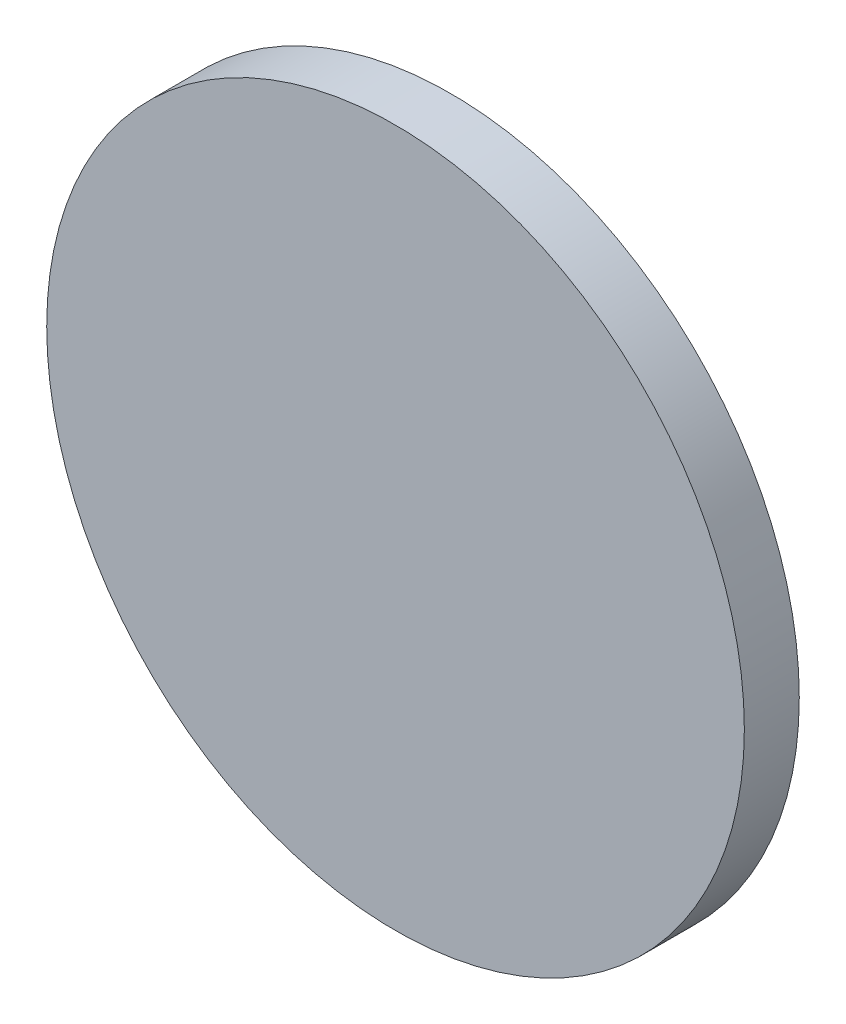
ISO-10303-21;
HEADER;
FILE_DESCRIPTION(('STEP AP214'),'2;1');
FILE_NAME('part.step','',(''),(''),'','','');
FILE_SCHEMA(('AUTOMOTIVE_DESIGN { 1 0 10303 214 1 1 1 1 }'));
ENDSEC;
DATA;
#1=APPLICATION_CONTEXT('core data for automotive mechanical design processes');
#2=APPLICATION_PROTOCOL_DEFINITION('international standard','automotive_design',2000,#1);
#3=PRODUCT_CONTEXT('',#1,'mechanical');
#4=PRODUCT('Part','Part','',(#3));
#5=PRODUCT_RELATED_PRODUCT_CATEGORY('part','',(#4));
#6=PRODUCT_DEFINITION_FORMATION('','',#4);
#7=PRODUCT_DEFINITION_CONTEXT('part definition',#1,'design');
#8=PRODUCT_DEFINITION('design','',#6,#7);
#9=PRODUCT_DEFINITION_SHAPE('','',#8);
#10=(LENGTH_UNIT() NAMED_UNIT(*) SI_UNIT(.MILLI.,.METRE.));
#11=(NAMED_UNIT(*) PLANE_ANGLE_UNIT() SI_UNIT($,.RADIAN.));
#12=(NAMED_UNIT(*) SI_UNIT($,.STERADIAN.) SOLID_ANGLE_UNIT());
#13=UNCERTAINTY_MEASURE_WITH_UNIT(LENGTH_MEASURE(1.E-05),#10,'distance_accuracy_value','');
#14=(GEOMETRIC_REPRESENTATION_CONTEXT(3) GLOBAL_UNCERTAINTY_ASSIGNED_CONTEXT((#13)) GLOBAL_UNIT_ASSIGNED_CONTEXT((#10,
#11,#12)) REPRESENTATION_CONTEXT('',''));
#15=CARTESIAN_POINT('',(0.,0.,0.));
#16=DIRECTION('',(0.,0.,1.));
#17=DIRECTION('',(1.,0.,0.));
#18=AXIS2_PLACEMENT_3D('',#15,#16,#17);
#19=CARTESIAN_POINT('',(0.,0.,4.));
#20=DIRECTION('',(0.,0.,-1.));
#21=DIRECTION('',(-1.,0.,0.));
#22=AXIS2_PLACEMENT_3D('',#19,#20,#21);
#23=CYLINDRICAL_SURFACE('',#22,25.4);
#24=CARTESIAN_POINT('',(0.,0.,4.));
#25=DIRECTION('',(0.,0.,1.));
#26=DIRECTION('',(1.,0.,0.));
#27=AXIS2_PLACEMENT_3D('',#24,#25,#26);
#28=CIRCLE('',#27,25.4);
#29=CARTESIAN_POINT('',(25.4,0.,4.));
#30=VERTEX_POINT('',#29);
#31=EDGE_CURVE('E10',#30,#30,#28,.T.);
#32=ORIENTED_EDGE('',*,*,#31,.F.);
#33=EDGE_LOOP('',(#32));
#34=FACE_BOUND('',#33,.T.);
#35=CARTESIAN_POINT('',(0.,0.,0.));
#36=DIRECTION('',(0.,0.,1.));
#37=DIRECTION('',(1.,0.,0.));
#38=AXIS2_PLACEMENT_3D('',#35,#36,#37);
#39=CIRCLE('',#38,25.4);
#40=CARTESIAN_POINT('',(25.4,0.,0.));
#41=VERTEX_POINT('',#40);
#42=EDGE_CURVE('E38',#41,#41,#39,.T.);
#43=ORIENTED_EDGE('',*,*,#42,.T.);
#44=EDGE_LOOP('',(#43));
#45=FACE_BOUND('',#44,.T.);
#46=ADVANCED_FACE('F35',(#34,#45),#23,.T.);
#47=CARTESIAN_POINT('',(0.,0.,4.));
#48=DIRECTION('',(0.,0.,1.));
#49=DIRECTION('',(1.,0.,0.));
#50=AXIS2_PLACEMENT_3D('',#47,#48,#49);
#51=PLANE('',#50);
#52=ORIENTED_EDGE('',*,*,#31,.T.);
#53=EDGE_LOOP('',(#52));
#54=FACE_BOUND('',#53,.T.);
#55=ADVANCED_FACE('F50',(#54),#51,.T.);
#56=CARTESIAN_POINT('',(0.,0.,0.));
#57=DIRECTION('',(0.,0.,1.));
#58=DIRECTION('',(1.,0.,0.));
#59=AXIS2_PLACEMENT_3D('',#56,#57,#58);
#60=PLANE('',#59);
#61=ORIENTED_EDGE('',*,*,#42,.F.);
#62=EDGE_LOOP('',(#61));
#63=FACE_BOUND('',#62,.T.);
#64=ADVANCED_FACE('F48',(#63),#60,.F.);
#65=CLOSED_SHELL('',(#46,#55,#64));
#66=MANIFOLD_SOLID_BREP('B2',#65);
#67=ADVANCED_BREP_SHAPE_REPRESENTATION('',(#18,#66),#14);
#68=SHAPE_DEFINITION_REPRESENTATION(#9,#67);
ENDSEC;
END-ISO-10303-21;
